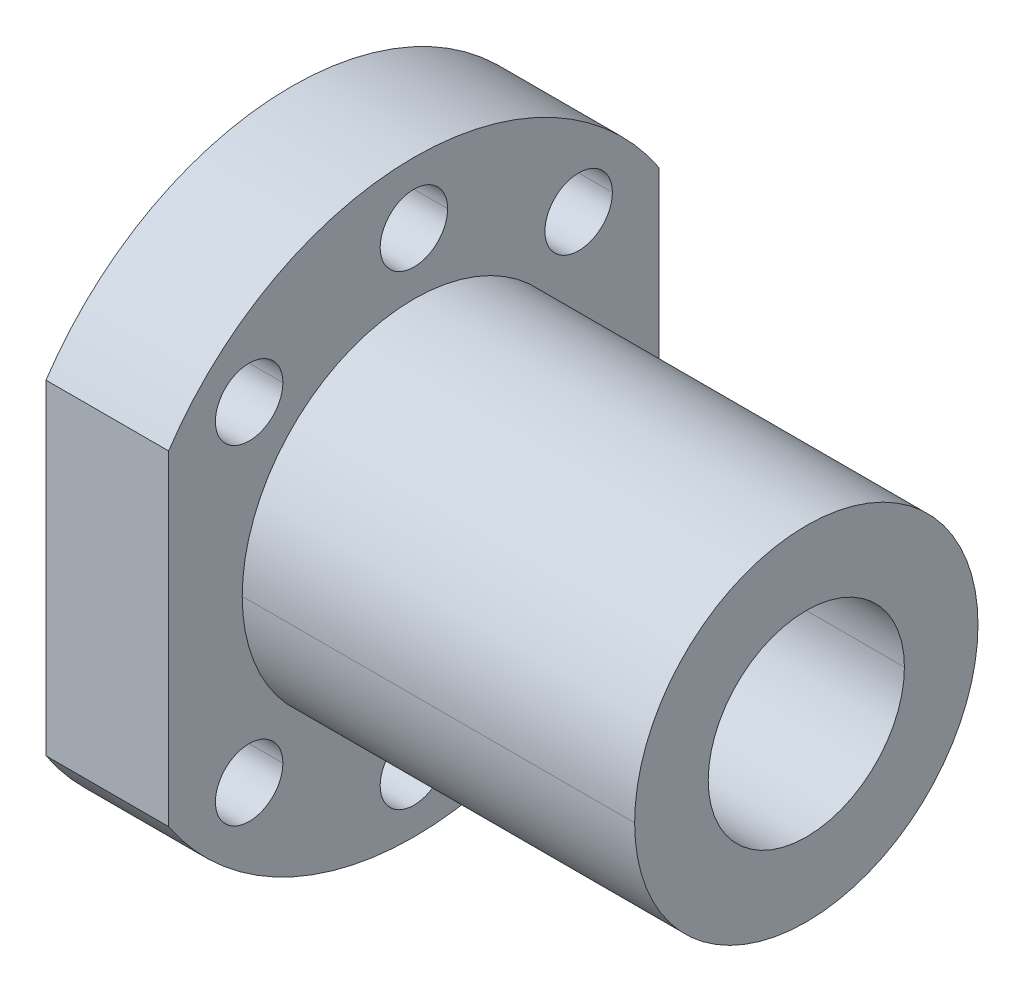
ISO-10303-21;
HEADER;
FILE_DESCRIPTION(('STEP AP214'),'2;1');
FILE_NAME('part.step','',(''),(''),'','','');
FILE_SCHEMA(('AUTOMOTIVE_DESIGN { 1 0 10303 214 1 1 1 1 }'));
ENDSEC;
DATA;
#1=APPLICATION_CONTEXT('core data for automotive mechanical design processes');
#2=APPLICATION_PROTOCOL_DEFINITION('international standard','automotive_design',2000,#1);
#3=PRODUCT_CONTEXT('',#1,'mechanical');
#4=PRODUCT('Part','Part','',(#3));
#5=PRODUCT_RELATED_PRODUCT_CATEGORY('part','',(#4));
#6=PRODUCT_DEFINITION_FORMATION('','',#4);
#7=PRODUCT_DEFINITION_CONTEXT('part definition',#1,'design');
#8=PRODUCT_DEFINITION('design','',#6,#7);
#9=PRODUCT_DEFINITION_SHAPE('','',#8);
#10=(LENGTH_UNIT() NAMED_UNIT(*) SI_UNIT(.MILLI.,.METRE.));
#11=(NAMED_UNIT(*) PLANE_ANGLE_UNIT() SI_UNIT($,.RADIAN.));
#12=(NAMED_UNIT(*) SI_UNIT($,.STERADIAN.) SOLID_ANGLE_UNIT());
#13=UNCERTAINTY_MEASURE_WITH_UNIT(LENGTH_MEASURE(1.E-05),#10,'distance_accuracy_value','');
#14=(GEOMETRIC_REPRESENTATION_CONTEXT(3) GLOBAL_UNCERTAINTY_ASSIGNED_CONTEXT((#13)) GLOBAL_UNIT_ASSIGNED_CONTEXT((#10,
#11,#12)) REPRESENTATION_CONTEXT('',''));
#15=CARTESIAN_POINT('',(0.,0.,0.));
#16=DIRECTION('',(0.,0.,1.));
#17=DIRECTION('',(1.,0.,0.));
#18=AXIS2_PLACEMENT_3D('',#15,#16,#17);
#19=CARTESIAN_POINT('',(42.,0.,0.));
#20=DIRECTION('',(1.,0.,0.));
#21=DIRECTION('',(0.,1.,0.));
#22=AXIS2_PLACEMENT_3D('',#19,#20,#21);
#23=PLANE('',#22);
#24=CARTESIAN_POINT('',(42.,0.,0.));
#25=DIRECTION('',(1.,0.,0.));
#26=DIRECTION('',(0.,0.,-1.));
#27=AXIS2_PLACEMENT_3D('',#24,#25,#26);
#28=CIRCLE('',#27,8.);
#29=CARTESIAN_POINT('',(42.,0.,-8.));
#30=VERTEX_POINT('',#29);
#31=CARTESIAN_POINT('',(42.,0.,8.));
#32=VERTEX_POINT('',#31);
#33=EDGE_CURVE('E10',#30,#32,#28,.T.);
#34=ORIENTED_EDGE('',*,*,#33,.F.);
#35=CARTESIAN_POINT('',(42.,0.,0.));
#36=DIRECTION('',(1.,0.,0.));
#37=DIRECTION('',(0.,0.,-1.));
#38=AXIS2_PLACEMENT_3D('',#35,#36,#37);
#39=CIRCLE('',#38,8.);
#40=EDGE_CURVE('E435',#32,#30,#39,.T.);
#41=ORIENTED_EDGE('',*,*,#40,.F.);
#42=EDGE_LOOP('',(#34,#41));
#43=FACE_BOUND('',#42,.T.);
#44=CARTESIAN_POINT('',(42.,0.,0.));
#45=DIRECTION('',(1.,0.,0.));
#46=DIRECTION('',(0.,0.,-1.));
#47=AXIS2_PLACEMENT_3D('',#44,#45,#46);
#48=CIRCLE('',#47,14.);
#49=CARTESIAN_POINT('',(42.,0.,14.));
#50=VERTEX_POINT('',#49);
#51=CARTESIAN_POINT('',(42.,0.,-14.));
#52=VERTEX_POINT('',#51);
#53=EDGE_CURVE('E318',#50,#52,#48,.T.);
#54=ORIENTED_EDGE('',*,*,#53,.T.);
#55=CARTESIAN_POINT('',(42.,0.,0.));
#56=DIRECTION('',(1.,0.,0.));
#57=DIRECTION('',(0.,0.,-1.));
#58=AXIS2_PLACEMENT_3D('',#55,#56,#57);
#59=CIRCLE('',#58,14.);
#60=EDGE_CURVE('E352',#52,#50,#59,.T.);
#61=ORIENTED_EDGE('',*,*,#60,.T.);
#62=EDGE_LOOP('',(#54,#61));
#63=FACE_BOUND('',#62,.T.);
#64=ADVANCED_FACE('F15',(#43,#63),#23,.T.);
#65=CARTESIAN_POINT('',(0.,0.,0.));
#66=DIRECTION('',(1.,0.,0.));
#67=DIRECTION('',(0.,0.,-1.));
#68=AXIS2_PLACEMENT_3D('',#65,#66,#67);
#69=CYLINDRICAL_SURFACE('',#68,8.);
#70=DIRECTION('',(1.,0.,0.));
#71=VECTOR('',#70,1.);
#72=CARTESIAN_POINT('',(0.,0.,8.));
#73=LINE('',#72,#71);
#74=CARTESIAN_POINT('',(0.,0.,8.));
#75=VERTEX_POINT('',#74);
#76=EDGE_CURVE('E302',#75,#32,#73,.T.);
#77=ORIENTED_EDGE('',*,*,#76,.F.);
#78=CARTESIAN_POINT('',(0.,0.,0.));
#79=DIRECTION('',(1.,0.,0.));
#80=DIRECTION('',(0.,0.,-1.));
#81=AXIS2_PLACEMENT_3D('',#78,#79,#80);
#82=CIRCLE('',#81,8.);
#83=CARTESIAN_POINT('',(0.,0.,-8.));
#84=VERTEX_POINT('',#83);
#85=EDGE_CURVE('E353',#84,#75,#82,.T.);
#86=ORIENTED_EDGE('',*,*,#85,.F.);
#87=DIRECTION('',(1.,0.,0.));
#88=VECTOR('',#87,1.);
#89=CARTESIAN_POINT('',(0.,0.,-8.));
#90=LINE('',#89,#88);
#91=EDGE_CURVE('E25',#84,#30,#90,.T.);
#92=ORIENTED_EDGE('',*,*,#91,.T.);
#93=ORIENTED_EDGE('',*,*,#33,.T.);
#94=EDGE_LOOP('',(#77,#86,#92,#93));
#95=FACE_BOUND('',#94,.T.);
#96=ADVANCED_FACE('F467',(#95),#69,.F.);
#97=CARTESIAN_POINT('',(0.,0.,0.));
#98=DIRECTION('',(1.,0.,0.));
#99=DIRECTION('',(0.,0.,-1.));
#100=AXIS2_PLACEMENT_3D('',#97,#98,#99);
#101=CYLINDRICAL_SURFACE('',#100,8.);
#102=CARTESIAN_POINT('',(0.,0.,0.));
#103=DIRECTION('',(1.,0.,0.));
#104=DIRECTION('',(0.,0.,-1.));
#105=AXIS2_PLACEMENT_3D('',#102,#103,#104);
#106=CIRCLE('',#105,8.);
#107=EDGE_CURVE('E357',#75,#84,#106,.T.);
#108=ORIENTED_EDGE('',*,*,#107,.F.);
#109=ORIENTED_EDGE('',*,*,#76,.T.);
#110=ORIENTED_EDGE('',*,*,#40,.T.);
#111=ORIENTED_EDGE('',*,*,#91,.F.);
#112=EDGE_LOOP('',(#108,#109,#110,#111));
#113=FACE_BOUND('',#112,.T.);
#114=ADVANCED_FACE('F465',(#113),#101,.F.);
#115=CARTESIAN_POINT('',(0.,-13.4350288425445,13.4350288425443));
#116=DIRECTION('',(1.,0.,0.));
#117=DIRECTION('',(0.,0.,-1.));
#118=AXIS2_PLACEMENT_3D('',#115,#116,#117);
#119=CYLINDRICAL_SURFACE('',#118,2.75);
#120=DIRECTION('',(1.,0.,0.));
#121=VECTOR('',#120,1.);
#122=CARTESIAN_POINT('',(0.,-13.4350288425445,16.1850288425444));
#123=LINE('',#122,#121);
#124=CARTESIAN_POINT('',(0.,-13.4350288425445,16.1850288425444));
#125=VERTEX_POINT('',#124);
#126=CARTESIAN_POINT('',(10.,-13.4350288425445,16.1850288425444));
#127=VERTEX_POINT('',#126);
#128=EDGE_CURVE('E208',#125,#127,#123,.T.);
#129=ORIENTED_EDGE('',*,*,#128,.F.);
#130=CARTESIAN_POINT('',(0.,-13.4350288425445,13.4350288425443));
#131=DIRECTION('',(1.,0.,0.));
#132=DIRECTION('',(0.,0.,-1.));
#133=AXIS2_PLACEMENT_3D('',#130,#131,#132);
#134=CIRCLE('',#133,2.75);
#135=CARTESIAN_POINT('',(0.,-13.4350288425445,10.6850288425443));
#136=VERTEX_POINT('',#135);
#137=EDGE_CURVE('E287',#136,#125,#134,.T.);
#138=ORIENTED_EDGE('',*,*,#137,.F.);
#139=DIRECTION('',(1.,0.,0.));
#140=VECTOR('',#139,1.);
#141=CARTESIAN_POINT('',(0.,-13.4350288425445,10.6850288425443));
#142=LINE('',#141,#140);
#143=CARTESIAN_POINT('',(10.,-13.4350288425445,10.6850288425443));
#144=VERTEX_POINT('',#143);
#145=EDGE_CURVE('E199',#136,#144,#142,.T.);
#146=ORIENTED_EDGE('',*,*,#145,.T.);
#147=CARTESIAN_POINT('',(10.,-13.4350288425445,13.4350288425443));
#148=DIRECTION('',(1.,0.,0.));
#149=DIRECTION('',(0.,0.,-1.));
#150=AXIS2_PLACEMENT_3D('',#147,#148,#149);
#151=CIRCLE('',#150,2.75);
#152=EDGE_CURVE('E248',#144,#127,#151,.T.);
#153=ORIENTED_EDGE('',*,*,#152,.T.);
#154=EDGE_LOOP('',(#129,#138,#146,#153));
#155=FACE_BOUND('',#154,.T.);
#156=ADVANCED_FACE('F495',(#155),#119,.F.);
#157=CARTESIAN_POINT('',(0.,-13.4350288425445,13.4350288425443));
#158=DIRECTION('',(1.,0.,0.));
#159=DIRECTION('',(0.,0.,-1.));
#160=AXIS2_PLACEMENT_3D('',#157,#158,#159);
#161=CYLINDRICAL_SURFACE('',#160,2.75);
#162=CARTESIAN_POINT('',(0.,-13.4350288425445,13.4350288425443));
#163=DIRECTION('',(1.,0.,0.));
#164=DIRECTION('',(0.,0.,-1.));
#165=AXIS2_PLACEMENT_3D('',#162,#163,#164);
#166=CIRCLE('',#165,2.75);
#167=EDGE_CURVE('E371',#125,#136,#166,.T.);
#168=ORIENTED_EDGE('',*,*,#167,.F.);
#169=ORIENTED_EDGE('',*,*,#128,.T.);
#170=CARTESIAN_POINT('',(10.,-13.4350288425445,13.4350288425443));
#171=DIRECTION('',(1.,0.,0.));
#172=DIRECTION('',(0.,0.,-1.));
#173=AXIS2_PLACEMENT_3D('',#170,#171,#172);
#174=CIRCLE('',#173,2.75);
#175=EDGE_CURVE('E284',#127,#144,#174,.T.);
#176=ORIENTED_EDGE('',*,*,#175,.T.);
#177=ORIENTED_EDGE('',*,*,#145,.F.);
#178=EDGE_LOOP('',(#168,#169,#176,#177));
#179=FACE_BOUND('',#178,.T.);
#180=ADVANCED_FACE('F521',(#179),#161,.F.);
#181=CARTESIAN_POINT('',(0.,24.,-20.));
#182=DIRECTION('',(0.,0.,1.));
#183=DIRECTION('',(0.,-1.,0.));
#184=AXIS2_PLACEMENT_3D('',#181,#182,#183);
#185=PLANE('',#184);
#186=DIRECTION('',(0.,-1.,0.));
#187=VECTOR('',#186,1.);
#188=CARTESIAN_POINT('',(10.,0.,-20.));
#189=LINE('',#188,#187);
#190=CARTESIAN_POINT('',(10.,13.2664991614216,-20.));
#191=VERTEX_POINT('',#190);
#192=CARTESIAN_POINT('',(10.,-13.2664991614216,-20.));
#193=VERTEX_POINT('',#192);
#194=EDGE_CURVE('E268',#191,#193,#189,.T.);
#195=ORIENTED_EDGE('',*,*,#194,.T.);
#196=DIRECTION('',(1.,0.,0.));
#197=VECTOR('',#196,1.);
#198=CARTESIAN_POINT('',(10.,-13.2664991614216,-20.));
#199=LINE('',#198,#197);
#200=CARTESIAN_POINT('',(0.,-13.2664991614216,-20.));
#201=VERTEX_POINT('',#200);
#202=EDGE_CURVE('E310',#201,#193,#199,.T.);
#203=ORIENTED_EDGE('',*,*,#202,.F.);
#204=DIRECTION('',(0.,-1.,0.));
#205=VECTOR('',#204,1.);
#206=CARTESIAN_POINT('',(0.,0.,-20.));
#207=LINE('',#206,#205);
#208=CARTESIAN_POINT('',(0.,13.2664991614216,-20.));
#209=VERTEX_POINT('',#208);
#210=EDGE_CURVE('E323',#209,#201,#207,.T.);
#211=ORIENTED_EDGE('',*,*,#210,.F.);
#212=DIRECTION('',(-1.,0.,0.));
#213=VECTOR('',#212,1.);
#214=CARTESIAN_POINT('',(10.,13.2664991614216,-20.));
#215=LINE('',#214,#213);
#216=EDGE_CURVE('E19',#191,#209,#215,.T.);
#217=ORIENTED_EDGE('',*,*,#216,.F.);
#218=EDGE_LOOP('',(#195,#203,#211,#217));
#219=FACE_BOUND('',#218,.T.);
#220=ADVANCED_FACE('F17',(#219),#185,.F.);
#221=CARTESIAN_POINT('',(10.,0.,0.));
#222=DIRECTION('',(-1.,0.,0.));
#223=DIRECTION('',(0.,0.,1.));
#224=AXIS2_PLACEMENT_3D('',#221,#222,#223);
#225=CYLINDRICAL_SURFACE('',#224,24.);
#226=CARTESIAN_POINT('',(0.,0.,0.));
#227=DIRECTION('',(1.,0.,0.));
#228=DIRECTION('',(0.,0.,-1.));
#229=AXIS2_PLACEMENT_3D('',#226,#227,#228);
#230=CIRCLE('',#229,24.);
#231=CARTESIAN_POINT('',(0.,-13.2664991614216,20.));
#232=VERTEX_POINT('',#231);
#233=EDGE_CURVE('E319',#232,#201,#230,.T.);
#234=ORIENTED_EDGE('',*,*,#233,.T.);
#235=ORIENTED_EDGE('',*,*,#202,.T.);
#236=CARTESIAN_POINT('',(10.,0.,0.));
#237=DIRECTION('',(1.,0.,0.));
#238=DIRECTION('',(0.,0.,-1.));
#239=AXIS2_PLACEMENT_3D('',#236,#237,#238);
#240=CIRCLE('',#239,24.);
#241=CARTESIAN_POINT('',(10.,-13.2664991614216,20.));
#242=VERTEX_POINT('',#241);
#243=EDGE_CURVE('E277',#242,#193,#240,.T.);
#244=ORIENTED_EDGE('',*,*,#243,.F.);
#245=DIRECTION('',(-1.,0.,0.));
#246=VECTOR('',#245,1.);
#247=CARTESIAN_POINT('',(10.,-13.2664991614216,20.));
#248=LINE('',#247,#246);
#249=EDGE_CURVE('E126',#242,#232,#248,.T.);
#250=ORIENTED_EDGE('',*,*,#249,.T.);
#251=EDGE_LOOP('',(#234,#235,#244,#250));
#252=FACE_BOUND('',#251,.T.);
#253=ADVANCED_FACE('F496',(#252),#225,.T.);
#254=CARTESIAN_POINT('',(10.,0.,0.));
#255=DIRECTION('',(-1.,0.,0.));
#256=DIRECTION('',(0.,0.,1.));
#257=AXIS2_PLACEMENT_3D('',#254,#255,#256);
#258=CYLINDRICAL_SURFACE('',#257,24.);
#259=CARTESIAN_POINT('',(10.,0.,0.));
#260=DIRECTION('',(1.,0.,0.));
#261=DIRECTION('',(0.,0.,-1.));
#262=AXIS2_PLACEMENT_3D('',#259,#260,#261);
#263=CIRCLE('',#262,24.);
#264=CARTESIAN_POINT('',(10.,13.2664991614216,20.));
#265=VERTEX_POINT('',#264);
#266=EDGE_CURVE('E278',#191,#265,#263,.T.);
#267=ORIENTED_EDGE('',*,*,#266,.F.);
#268=ORIENTED_EDGE('',*,*,#216,.T.);
#269=CARTESIAN_POINT('',(0.,0.,0.));
#270=DIRECTION('',(1.,0.,0.));
#271=DIRECTION('',(0.,0.,-1.));
#272=AXIS2_PLACEMENT_3D('',#269,#270,#271);
#273=CIRCLE('',#272,24.);
#274=CARTESIAN_POINT('',(0.,13.2664991614216,20.));
#275=VERTEX_POINT('',#274);
#276=EDGE_CURVE('E333',#209,#275,#273,.T.);
#277=ORIENTED_EDGE('',*,*,#276,.T.);
#278=DIRECTION('',(1.,0.,0.));
#279=VECTOR('',#278,1.);
#280=CARTESIAN_POINT('',(10.,13.2664991614216,20.));
#281=LINE('',#280,#279);
#282=EDGE_CURVE('E377',#275,#265,#281,.T.);
#283=ORIENTED_EDGE('',*,*,#282,.T.);
#284=EDGE_LOOP('',(#267,#268,#277,#283));
#285=FACE_BOUND('',#284,.T.);
#286=ADVANCED_FACE('F498',(#285),#258,.T.);
#287=CARTESIAN_POINT('',(0.,-19.,0.));
#288=DIRECTION('',(1.,0.,0.));
#289=DIRECTION('',(0.,0.,-1.));
#290=AXIS2_PLACEMENT_3D('',#287,#288,#289);
#291=CYLINDRICAL_SURFACE('',#290,2.75);
#292=DIRECTION('',(1.,0.,0.));
#293=VECTOR('',#292,1.);
#294=CARTESIAN_POINT('',(0.,-19.,2.75));
#295=LINE('',#294,#293);
#296=CARTESIAN_POINT('',(0.,-19.,2.75));
#297=VERTEX_POINT('',#296);
#298=CARTESIAN_POINT('',(10.,-19.,2.75));
#299=VERTEX_POINT('',#298);
#300=EDGE_CURVE('E229',#297,#299,#295,.T.);
#301=ORIENTED_EDGE('',*,*,#300,.F.);
#302=CARTESIAN_POINT('',(0.,-19.,0.));
#303=DIRECTION('',(1.,0.,0.));
#304=DIRECTION('',(0.,0.,-1.));
#305=AXIS2_PLACEMENT_3D('',#302,#303,#304);
#306=CIRCLE('',#305,2.75);
#307=CARTESIAN_POINT('',(0.,-19.,-2.75));
#308=VERTEX_POINT('',#307);
#309=EDGE_CURVE('E288',#308,#297,#306,.T.);
#310=ORIENTED_EDGE('',*,*,#309,.F.);
#311=DIRECTION('',(1.,0.,0.));
#312=VECTOR('',#311,1.);
#313=CARTESIAN_POINT('',(0.,-19.,-2.75));
#314=LINE('',#313,#312);
#315=CARTESIAN_POINT('',(10.,-19.,-2.75));
#316=VERTEX_POINT('',#315);
#317=EDGE_CURVE('E241',#308,#316,#314,.T.);
#318=ORIENTED_EDGE('',*,*,#317,.T.);
#319=CARTESIAN_POINT('',(10.,-19.,0.));
#320=DIRECTION('',(1.,0.,0.));
#321=DIRECTION('',(0.,0.,-1.));
#322=AXIS2_PLACEMENT_3D('',#319,#320,#321);
#323=CIRCLE('',#322,2.75);
#324=EDGE_CURVE('E246',#316,#299,#323,.T.);
#325=ORIENTED_EDGE('',*,*,#324,.T.);
#326=EDGE_LOOP('',(#301,#310,#318,#325));
#327=FACE_BOUND('',#326,.T.);
#328=ADVANCED_FACE('F250',(#327),#291,.F.);
#329=CARTESIAN_POINT('',(0.,-13.4350288425445,-13.4350288425443));
#330=DIRECTION('',(1.,0.,0.));
#331=DIRECTION('',(0.,0.,-1.));
#332=AXIS2_PLACEMENT_3D('',#329,#330,#331);
#333=CYLINDRICAL_SURFACE('',#332,2.75);
#334=CARTESIAN_POINT('',(0.,-13.4350288425445,-13.4350288425443));
#335=DIRECTION('',(1.,0.,0.));
#336=DIRECTION('',(0.,0.,-1.));
#337=AXIS2_PLACEMENT_3D('',#334,#335,#336);
#338=CIRCLE('',#337,2.75);
#339=CARTESIAN_POINT('',(0.,-13.4350288425445,-10.6850288425443));
#340=VERTEX_POINT('',#339);
#341=CARTESIAN_POINT('',(0.,-13.4350288425445,-16.1850288425444));
#342=VERTEX_POINT('',#341);
#343=EDGE_CURVE('E303',#340,#342,#338,.T.);
#344=ORIENTED_EDGE('',*,*,#343,.F.);
#345=DIRECTION('',(1.,0.,0.));
#346=VECTOR('',#345,1.);
#347=CARTESIAN_POINT('',(0.,-13.4350288425445,-10.6850288425443));
#348=LINE('',#347,#346);
#349=CARTESIAN_POINT('',(10.,-13.4350288425445,-10.6850288425443));
#350=VERTEX_POINT('',#349);
#351=EDGE_CURVE('E317',#340,#350,#348,.T.);
#352=ORIENTED_EDGE('',*,*,#351,.T.);
#353=CARTESIAN_POINT('',(10.,-13.4350288425445,-13.4350288425443));
#354=DIRECTION('',(1.,0.,0.));
#355=DIRECTION('',(0.,0.,-1.));
#356=AXIS2_PLACEMENT_3D('',#353,#354,#355);
#357=CIRCLE('',#356,2.75);
#358=CARTESIAN_POINT('',(10.,-13.4350288425445,-16.1850288425444));
#359=VERTEX_POINT('',#358);
#360=EDGE_CURVE('E252',#350,#359,#357,.T.);
#361=ORIENTED_EDGE('',*,*,#360,.T.);
#362=DIRECTION('',(1.,0.,0.));
#363=VECTOR('',#362,1.);
#364=CARTESIAN_POINT('',(0.,-13.4350288425445,-16.1850288425444));
#365=LINE('',#364,#363);
#366=EDGE_CURVE('E110',#342,#359,#365,.T.);
#367=ORIENTED_EDGE('',*,*,#366,.F.);
#368=EDGE_LOOP('',(#344,#352,#361,#367));
#369=FACE_BOUND('',#368,.T.);
#370=ADVANCED_FACE('F488',(#369),#333,.F.);
#371=CARTESIAN_POINT('',(0.,19.,0.));
#372=DIRECTION('',(1.,0.,0.));
#373=DIRECTION('',(0.,0.,-1.));
#374=AXIS2_PLACEMENT_3D('',#371,#372,#373);
#375=CYLINDRICAL_SURFACE('',#374,2.75);
#376=CARTESIAN_POINT('',(0.,19.,0.));
#377=DIRECTION('',(1.,0.,0.));
#378=DIRECTION('',(0.,0.,-1.));
#379=AXIS2_PLACEMENT_3D('',#376,#377,#378);
#380=CIRCLE('',#379,2.75);
#381=CARTESIAN_POINT('',(0.,19.,2.75));
#382=VERTEX_POINT('',#381);
#383=CARTESIAN_POINT('',(0.,19.,-2.75));
#384=VERTEX_POINT('',#383);
#385=EDGE_CURVE('E289',#382,#384,#380,.T.);
#386=ORIENTED_EDGE('',*,*,#385,.F.);
#387=DIRECTION('',(1.,0.,0.));
#388=VECTOR('',#387,1.);
#389=CARTESIAN_POINT('',(0.,19.,2.75));
#390=LINE('',#389,#388);
#391=CARTESIAN_POINT('',(10.,19.,2.75));
#392=VERTEX_POINT('',#391);
#393=EDGE_CURVE('E364',#382,#392,#390,.T.);
#394=ORIENTED_EDGE('',*,*,#393,.T.);
#395=CARTESIAN_POINT('',(10.,19.,0.));
#396=DIRECTION('',(1.,0.,0.));
#397=DIRECTION('',(0.,0.,-1.));
#398=AXIS2_PLACEMENT_3D('',#395,#396,#397);
#399=CIRCLE('',#398,2.75);
#400=CARTESIAN_POINT('',(10.,19.,-2.75));
#401=VERTEX_POINT('',#400);
#402=EDGE_CURVE('E299',#392,#401,#399,.T.);
#403=ORIENTED_EDGE('',*,*,#402,.T.);
#404=DIRECTION('',(1.,0.,0.));
#405=VECTOR('',#404,1.);
#406=CARTESIAN_POINT('',(0.,19.,-2.75));
#407=LINE('',#406,#405);
#408=EDGE_CURVE('E219',#384,#401,#407,.T.);
#409=ORIENTED_EDGE('',*,*,#408,.F.);
#410=EDGE_LOOP('',(#386,#394,#403,#409));
#411=FACE_BOUND('',#410,.T.);
#412=ADVANCED_FACE('F491',(#411),#375,.F.);
#413=CARTESIAN_POINT('',(0.,13.4350288425445,13.4350288425443));
#414=DIRECTION('',(1.,0.,0.));
#415=DIRECTION('',(0.,0.,-1.));
#416=AXIS2_PLACEMENT_3D('',#413,#414,#415);
#417=CYLINDRICAL_SURFACE('',#416,2.75);
#418=DIRECTION('',(1.,0.,0.));
#419=VECTOR('',#418,1.);
#420=CARTESIAN_POINT('',(0.,13.4350288425445,16.1850288425444));
#421=LINE('',#420,#419);
#422=CARTESIAN_POINT('',(0.,13.4350288425445,16.1850288425444));
#423=VERTEX_POINT('',#422);
#424=CARTESIAN_POINT('',(10.,13.4350288425445,16.1850288425444));
#425=VERTEX_POINT('',#424);
#426=EDGE_CURVE('E392',#423,#425,#421,.T.);
#427=ORIENTED_EDGE('',*,*,#426,.F.);
#428=CARTESIAN_POINT('',(0.,13.4350288425445,13.4350288425443));
#429=DIRECTION('',(1.,0.,0.));
#430=DIRECTION('',(0.,0.,-1.));
#431=AXIS2_PLACEMENT_3D('',#428,#429,#430);
#432=CIRCLE('',#431,2.75);
#433=CARTESIAN_POINT('',(0.,13.4350288425445,10.6850288425443));
#434=VERTEX_POINT('',#433);
#435=EDGE_CURVE('E291',#434,#423,#432,.T.);
#436=ORIENTED_EDGE('',*,*,#435,.F.);
#437=DIRECTION('',(1.,0.,0.));
#438=VECTOR('',#437,1.);
#439=CARTESIAN_POINT('',(0.,13.4350288425445,10.6850288425443));
#440=LINE('',#439,#438);
#441=CARTESIAN_POINT('',(10.,13.4350288425445,10.6850288425443));
#442=VERTEX_POINT('',#441);
#443=EDGE_CURVE('E389',#434,#442,#440,.T.);
#444=ORIENTED_EDGE('',*,*,#443,.T.);
#445=CARTESIAN_POINT('',(10.,13.4350288425445,13.4350288425443));
#446=DIRECTION('',(1.,0.,0.));
#447=DIRECTION('',(0.,0.,-1.));
#448=AXIS2_PLACEMENT_3D('',#445,#446,#447);
#449=CIRCLE('',#448,2.75);
#450=EDGE_CURVE('E294',#442,#425,#449,.T.);
#451=ORIENTED_EDGE('',*,*,#450,.T.);
#452=EDGE_LOOP('',(#427,#436,#444,#451));
#453=FACE_BOUND('',#452,.T.);
#454=ADVANCED_FACE('F476',(#453),#417,.F.);
#455=CARTESIAN_POINT('',(0.,13.4350288425445,13.4350288425443));
#456=DIRECTION('',(1.,0.,0.));
#457=DIRECTION('',(0.,0.,-1.));
#458=AXIS2_PLACEMENT_3D('',#455,#456,#457);
#459=CYLINDRICAL_SURFACE('',#458,2.75);
#460=CARTESIAN_POINT('',(0.,13.4350288425445,13.4350288425443));
#461=DIRECTION('',(1.,0.,0.));
#462=DIRECTION('',(0.,0.,-1.));
#463=AXIS2_PLACEMENT_3D('',#460,#461,#462);
#464=CIRCLE('',#463,2.75);
#465=EDGE_CURVE('E262',#423,#434,#464,.T.);
#466=ORIENTED_EDGE('',*,*,#465,.F.);
#467=ORIENTED_EDGE('',*,*,#426,.T.);
#468=CARTESIAN_POINT('',(10.,13.4350288425445,13.4350288425443));
#469=DIRECTION('',(1.,0.,0.));
#470=DIRECTION('',(0.,0.,-1.));
#471=AXIS2_PLACEMENT_3D('',#468,#469,#470);
#472=CIRCLE('',#471,2.75);
#473=EDGE_CURVE('E298',#425,#442,#472,.T.);
#474=ORIENTED_EDGE('',*,*,#473,.T.);
#475=ORIENTED_EDGE('',*,*,#443,.F.);
#476=EDGE_LOOP('',(#466,#467,#474,#475));
#477=FACE_BOUND('',#476,.T.);
#478=ADVANCED_FACE('F509',(#477),#459,.F.);
#479=CARTESIAN_POINT('',(0.,24.8623728813561,20.));
#480=DIRECTION('',(0.,0.,-1.));
#481=DIRECTION('',(0.,-1.,0.));
#482=AXIS2_PLACEMENT_3D('',#479,#480,#481);
#483=PLANE('',#482);
#484=DIRECTION('',(0.,1.,0.));
#485=VECTOR('',#484,1.);
#486=CARTESIAN_POINT('',(10.,0.,20.));
#487=LINE('',#486,#485);
#488=EDGE_CURVE('E274',#242,#265,#487,.T.);
#489=ORIENTED_EDGE('',*,*,#488,.T.);
#490=ORIENTED_EDGE('',*,*,#282,.F.);
#491=DIRECTION('',(0.,1.,0.));
#492=VECTOR('',#491,1.);
#493=CARTESIAN_POINT('',(0.,0.,20.));
#494=LINE('',#493,#492);
#495=EDGE_CURVE('E322',#232,#275,#494,.T.);
#496=ORIENTED_EDGE('',*,*,#495,.F.);
#497=ORIENTED_EDGE('',*,*,#249,.F.);
#498=EDGE_LOOP('',(#489,#490,#496,#497));
#499=FACE_BOUND('',#498,.T.);
#500=ADVANCED_FACE('F485',(#499),#483,.F.);
#501=CARTESIAN_POINT('',(42.,0.,0.));
#502=DIRECTION('',(-1.,0.,0.));
#503=DIRECTION('',(0.,0.,1.));
#504=AXIS2_PLACEMENT_3D('',#501,#502,#503);
#505=CYLINDRICAL_SURFACE('',#504,14.);
#506=ORIENTED_EDGE('',*,*,#60,.F.);
#507=DIRECTION('',(-1.,0.,0.));
#508=VECTOR('',#507,1.);
#509=CARTESIAN_POINT('',(42.,0.,-14.));
#510=LINE('',#509,#508);
#511=CARTESIAN_POINT('',(10.,0.,-14.));
#512=VERTEX_POINT('',#511);
#513=EDGE_CURVE('E360',#52,#512,#510,.T.);
#514=ORIENTED_EDGE('',*,*,#513,.T.);
#515=CARTESIAN_POINT('',(10.,0.,0.));
#516=DIRECTION('',(1.,0.,0.));
#517=DIRECTION('',(0.,0.,-1.));
#518=AXIS2_PLACEMENT_3D('',#515,#516,#517);
#519=CIRCLE('',#518,14.);
#520=CARTESIAN_POINT('',(10.,0.,14.));
#521=VERTEX_POINT('',#520);
#522=EDGE_CURVE('E383',#512,#521,#519,.T.);
#523=ORIENTED_EDGE('',*,*,#522,.T.);
#524=DIRECTION('',(-1.,0.,0.));
#525=VECTOR('',#524,1.);
#526=CARTESIAN_POINT('',(42.,0.,14.));
#527=LINE('',#526,#525);
#528=EDGE_CURVE('E315',#50,#521,#527,.T.);
#529=ORIENTED_EDGE('',*,*,#528,.F.);
#530=EDGE_LOOP('',(#506,#514,#523,#529));
#531=FACE_BOUND('',#530,.T.);
#532=ADVANCED_FACE('F414',(#531),#505,.T.);
#533=CARTESIAN_POINT('',(0.,-13.4350288425445,-13.4350288425443));
#534=DIRECTION('',(1.,0.,0.));
#535=DIRECTION('',(0.,0.,-1.));
#536=AXIS2_PLACEMENT_3D('',#533,#534,#535);
#537=CYLINDRICAL_SURFACE('',#536,2.75);
#538=ORIENTED_EDGE('',*,*,#351,.F.);
#539=CARTESIAN_POINT('',(0.,-13.4350288425445,-13.4350288425443));
#540=DIRECTION('',(1.,0.,0.));
#541=DIRECTION('',(0.,0.,-1.));
#542=AXIS2_PLACEMENT_3D('',#539,#540,#541);
#543=CIRCLE('',#542,2.75);
#544=EDGE_CURVE('E307',#342,#340,#543,.T.);
#545=ORIENTED_EDGE('',*,*,#544,.F.);
#546=ORIENTED_EDGE('',*,*,#366,.T.);
#547=CARTESIAN_POINT('',(10.,-13.4350288425445,-13.4350288425443));
#548=DIRECTION('',(1.,0.,0.));
#549=DIRECTION('',(0.,0.,-1.));
#550=AXIS2_PLACEMENT_3D('',#547,#548,#549);
#551=CIRCLE('',#550,2.75);
#552=EDGE_CURVE('E258',#359,#350,#551,.T.);
#553=ORIENTED_EDGE('',*,*,#552,.T.);
#554=EDGE_LOOP('',(#538,#545,#546,#553));
#555=FACE_BOUND('',#554,.T.);
#556=ADVANCED_FACE('F484',(#555),#537,.F.);
#557=CARTESIAN_POINT('',(42.,0.,0.));
#558=DIRECTION('',(-1.,0.,0.));
#559=DIRECTION('',(0.,0.,1.));
#560=AXIS2_PLACEMENT_3D('',#557,#558,#559);
#561=CYLINDRICAL_SURFACE('',#560,14.);
#562=ORIENTED_EDGE('',*,*,#513,.F.);
#563=ORIENTED_EDGE('',*,*,#53,.F.);
#564=ORIENTED_EDGE('',*,*,#528,.T.);
#565=CARTESIAN_POINT('',(10.,0.,0.));
#566=DIRECTION('',(1.,0.,0.));
#567=DIRECTION('',(0.,0.,-1.));
#568=AXIS2_PLACEMENT_3D('',#565,#566,#567);
#569=CIRCLE('',#568,14.);
#570=EDGE_CURVE('E314',#521,#512,#569,.T.);
#571=ORIENTED_EDGE('',*,*,#570,.T.);
#572=EDGE_LOOP('',(#562,#563,#564,#571));
#573=FACE_BOUND('',#572,.T.);
#574=ADVANCED_FACE('F409',(#573),#561,.T.);
#575=CARTESIAN_POINT('',(0.,-19.,0.));
#576=DIRECTION('',(1.,0.,0.));
#577=DIRECTION('',(0.,0.,-1.));
#578=AXIS2_PLACEMENT_3D('',#575,#576,#577);
#579=CYLINDRICAL_SURFACE('',#578,2.75);
#580=CARTESIAN_POINT('',(0.,-19.,0.));
#581=DIRECTION('',(1.,0.,0.));
#582=DIRECTION('',(0.,0.,-1.));
#583=AXIS2_PLACEMENT_3D('',#580,#581,#582);
#584=CIRCLE('',#583,2.75);
#585=EDGE_CURVE('E235',#297,#308,#584,.T.);
#586=ORIENTED_EDGE('',*,*,#585,.F.);
#587=ORIENTED_EDGE('',*,*,#300,.T.);
#588=CARTESIAN_POINT('',(10.,-19.,0.));
#589=DIRECTION('',(1.,0.,0.));
#590=DIRECTION('',(0.,0.,-1.));
#591=AXIS2_PLACEMENT_3D('',#588,#589,#590);
#592=CIRCLE('',#591,2.75);
#593=EDGE_CURVE('E232',#299,#316,#592,.T.);
#594=ORIENTED_EDGE('',*,*,#593,.T.);
#595=ORIENTED_EDGE('',*,*,#317,.F.);
#596=EDGE_LOOP('',(#586,#587,#594,#595));
#597=FACE_BOUND('',#596,.T.);
#598=ADVANCED_FACE('F231',(#597),#579,.F.);
#599=CARTESIAN_POINT('',(0.,19.,0.));
#600=DIRECTION('',(1.,0.,0.));
#601=DIRECTION('',(0.,0.,-1.));
#602=AXIS2_PLACEMENT_3D('',#599,#600,#601);
#603=CYLINDRICAL_SURFACE('',#602,2.75);
#604=ORIENTED_EDGE('',*,*,#393,.F.);
#605=CARTESIAN_POINT('',(0.,19.,0.));
#606=DIRECTION('',(1.,0.,0.));
#607=DIRECTION('',(0.,0.,-1.));
#608=AXIS2_PLACEMENT_3D('',#605,#606,#607);
#609=CIRCLE('',#608,2.75);
#610=EDGE_CURVE('E292',#384,#382,#609,.T.);
#611=ORIENTED_EDGE('',*,*,#610,.F.);
#612=ORIENTED_EDGE('',*,*,#408,.T.);
#613=CARTESIAN_POINT('',(10.,19.,0.));
#614=DIRECTION('',(1.,0.,0.));
#615=DIRECTION('',(0.,0.,-1.));
#616=AXIS2_PLACEMENT_3D('',#613,#614,#615);
#617=CIRCLE('',#616,2.75);
#618=EDGE_CURVE('E283',#401,#392,#617,.T.);
#619=ORIENTED_EDGE('',*,*,#618,.T.);
#620=EDGE_LOOP('',(#604,#611,#612,#619));
#621=FACE_BOUND('',#620,.T.);
#622=ADVANCED_FACE('F502',(#621),#603,.F.);
#623=CARTESIAN_POINT('',(0.,0.,0.));
#624=DIRECTION('',(1.,0.,0.));
#625=DIRECTION('',(0.,1.,0.));
#626=AXIS2_PLACEMENT_3D('',#623,#624,#625);
#627=PLANE('',#626);
#628=ORIENTED_EDGE('',*,*,#85,.T.);
#629=ORIENTED_EDGE('',*,*,#107,.T.);
#630=EDGE_LOOP('',(#628,#629));
#631=FACE_BOUND('',#630,.T.);
#632=ORIENTED_EDGE('',*,*,#435,.T.);
#633=ORIENTED_EDGE('',*,*,#465,.T.);
#634=EDGE_LOOP('',(#632,#633));
#635=FACE_BOUND('',#634,.T.);
#636=ORIENTED_EDGE('',*,*,#610,.T.);
#637=ORIENTED_EDGE('',*,*,#385,.T.);
#638=EDGE_LOOP('',(#636,#637));
#639=FACE_BOUND('',#638,.T.);
#640=CARTESIAN_POINT('',(0.,13.4350288425445,-13.4350288425443));
#641=DIRECTION('',(1.,0.,0.));
#642=DIRECTION('',(0.,0.,-1.));
#643=AXIS2_PLACEMENT_3D('',#640,#641,#642);
#644=CIRCLE('',#643,2.75);
#645=CARTESIAN_POINT('',(0.,13.4350288425445,-16.1850288425444));
#646=VERTEX_POINT('',#645);
#647=CARTESIAN_POINT('',(0.,13.4350288425445,-10.6850288425443));
#648=VERTEX_POINT('',#647);
#649=EDGE_CURVE('E273',#646,#648,#644,.T.);
#650=ORIENTED_EDGE('',*,*,#649,.T.);
#651=CARTESIAN_POINT('',(0.,13.4350288425445,-13.4350288425443));
#652=DIRECTION('',(1.,0.,0.));
#653=DIRECTION('',(0.,0.,-1.));
#654=AXIS2_PLACEMENT_3D('',#651,#652,#653);
#655=CIRCLE('',#654,2.75);
#656=EDGE_CURVE('E342',#648,#646,#655,.T.);
#657=ORIENTED_EDGE('',*,*,#656,.T.);
#658=EDGE_LOOP('',(#650,#657));
#659=FACE_BOUND('',#658,.T.);
#660=ORIENTED_EDGE('',*,*,#137,.T.);
#661=ORIENTED_EDGE('',*,*,#167,.T.);
#662=EDGE_LOOP('',(#660,#661));
#663=FACE_BOUND('',#662,.T.);
#664=ORIENTED_EDGE('',*,*,#309,.T.);
#665=ORIENTED_EDGE('',*,*,#585,.T.);
#666=EDGE_LOOP('',(#664,#665));
#667=FACE_BOUND('',#666,.T.);
#668=ORIENTED_EDGE('',*,*,#544,.T.);
#669=ORIENTED_EDGE('',*,*,#343,.T.);
#670=EDGE_LOOP('',(#668,#669));
#671=FACE_BOUND('',#670,.T.);
#672=ORIENTED_EDGE('',*,*,#276,.F.);
#673=ORIENTED_EDGE('',*,*,#210,.T.);
#674=ORIENTED_EDGE('',*,*,#233,.F.);
#675=ORIENTED_EDGE('',*,*,#495,.T.);
#676=EDGE_LOOP('',(#672,#673,#674,#675));
#677=FACE_BOUND('',#676,.T.);
#678=ADVANCED_FACE('F505',(#631,#635,#639,#659,#663,#667,#671,#677),#627,.F.);
#679=CARTESIAN_POINT('',(0.,13.4350288425445,-13.4350288425443));
#680=DIRECTION('',(1.,0.,0.));
#681=DIRECTION('',(0.,0.,-1.));
#682=AXIS2_PLACEMENT_3D('',#679,#680,#681);
#683=CYLINDRICAL_SURFACE('',#682,2.75);
#684=ORIENTED_EDGE('',*,*,#656,.F.);
#685=DIRECTION('',(1.,0.,0.));
#686=VECTOR('',#685,1.);
#687=CARTESIAN_POINT('',(0.,13.4350288425445,-10.6850288425443));
#688=LINE('',#687,#686);
#689=CARTESIAN_POINT('',(10.,13.4350288425445,-10.6850288425443));
#690=VERTEX_POINT('',#689);
#691=EDGE_CURVE('E346',#648,#690,#688,.T.);
#692=ORIENTED_EDGE('',*,*,#691,.T.);
#693=CARTESIAN_POINT('',(10.,13.4350288425445,-13.4350288425443));
#694=DIRECTION('',(1.,0.,0.));
#695=DIRECTION('',(0.,0.,-1.));
#696=AXIS2_PLACEMENT_3D('',#693,#694,#695);
#697=CIRCLE('',#696,2.75);
#698=CARTESIAN_POINT('',(10.,13.4350288425445,-16.1850288425444));
#699=VERTEX_POINT('',#698);
#700=EDGE_CURVE('E279',#690,#699,#697,.T.);
#701=ORIENTED_EDGE('',*,*,#700,.T.);
#702=DIRECTION('',(1.,0.,0.));
#703=VECTOR('',#702,1.);
#704=CARTESIAN_POINT('',(0.,13.4350288425445,-16.1850288425444));
#705=LINE('',#704,#703);
#706=EDGE_CURVE('E269',#646,#699,#705,.T.);
#707=ORIENTED_EDGE('',*,*,#706,.F.);
#708=EDGE_LOOP('',(#684,#692,#701,#707));
#709=FACE_BOUND('',#708,.T.);
#710=ADVANCED_FACE('F481',(#709),#683,.F.);
#711=CARTESIAN_POINT('',(10.,0.,0.));
#712=DIRECTION('',(1.,0.,0.));
#713=DIRECTION('',(0.,1.,0.));
#714=AXIS2_PLACEMENT_3D('',#711,#712,#713);
#715=PLANE('',#714);
#716=ORIENTED_EDGE('',*,*,#570,.F.);
#717=ORIENTED_EDGE('',*,*,#522,.F.);
#718=EDGE_LOOP('',(#716,#717));
#719=FACE_BOUND('',#718,.T.);
#720=ORIENTED_EDGE('',*,*,#450,.F.);
#721=ORIENTED_EDGE('',*,*,#473,.F.);
#722=EDGE_LOOP('',(#720,#721));
#723=FACE_BOUND('',#722,.T.);
#724=ORIENTED_EDGE('',*,*,#618,.F.);
#725=ORIENTED_EDGE('',*,*,#402,.F.);
#726=EDGE_LOOP('',(#724,#725));
#727=FACE_BOUND('',#726,.T.);
#728=CARTESIAN_POINT('',(10.,13.4350288425445,-13.4350288425443));
#729=DIRECTION('',(1.,0.,0.));
#730=DIRECTION('',(0.,0.,-1.));
#731=AXIS2_PLACEMENT_3D('',#728,#729,#730);
#732=CIRCLE('',#731,2.75);
#733=EDGE_CURVE('E264',#699,#690,#732,.T.);
#734=ORIENTED_EDGE('',*,*,#733,.F.);
#735=ORIENTED_EDGE('',*,*,#700,.F.);
#736=EDGE_LOOP('',(#734,#735));
#737=FACE_BOUND('',#736,.T.);
#738=ORIENTED_EDGE('',*,*,#152,.F.);
#739=ORIENTED_EDGE('',*,*,#175,.F.);
#740=EDGE_LOOP('',(#738,#739));
#741=FACE_BOUND('',#740,.T.);
#742=ORIENTED_EDGE('',*,*,#324,.F.);
#743=ORIENTED_EDGE('',*,*,#593,.F.);
#744=EDGE_LOOP('',(#742,#743));
#745=FACE_BOUND('',#744,.T.);
#746=ORIENTED_EDGE('',*,*,#552,.F.);
#747=ORIENTED_EDGE('',*,*,#360,.F.);
#748=EDGE_LOOP('',(#746,#747));
#749=FACE_BOUND('',#748,.T.);
#750=ORIENTED_EDGE('',*,*,#194,.F.);
#751=ORIENTED_EDGE('',*,*,#266,.T.);
#752=ORIENTED_EDGE('',*,*,#488,.F.);
#753=ORIENTED_EDGE('',*,*,#243,.T.);
#754=EDGE_LOOP('',(#750,#751,#752,#753));
#755=FACE_BOUND('',#754,.T.);
#756=ADVANCED_FACE('F244',(#719,#723,#727,#737,#741,#745,#749,#755),#715,.T.);
#757=CARTESIAN_POINT('',(0.,13.4350288425445,-13.4350288425443));
#758=DIRECTION('',(1.,0.,0.));
#759=DIRECTION('',(0.,0.,-1.));
#760=AXIS2_PLACEMENT_3D('',#757,#758,#759);
#761=CYLINDRICAL_SURFACE('',#760,2.75);
#762=ORIENTED_EDGE('',*,*,#691,.F.);
#763=ORIENTED_EDGE('',*,*,#649,.F.);
#764=ORIENTED_EDGE('',*,*,#706,.T.);
#765=ORIENTED_EDGE('',*,*,#733,.T.);
#766=EDGE_LOOP('',(#762,#763,#764,#765));
#767=FACE_BOUND('',#766,.T.);
#768=ADVANCED_FACE('F480',(#767),#761,.F.);
#769=CLOSED_SHELL('',(#64,#96,#114,#156,#180,#220,#253,#286,#328,#370,#412,#454,#478,#500,#532,
#556,#574,#598,#622,#678,#710,#756,#768));
#770=MANIFOLD_SOLID_BREP('B1',#769);
#771=ADVANCED_BREP_SHAPE_REPRESENTATION('',(#18,#770),#14);
#772=SHAPE_DEFINITION_REPRESENTATION(#9,#771);
ENDSEC;
END-ISO-10303-21;
